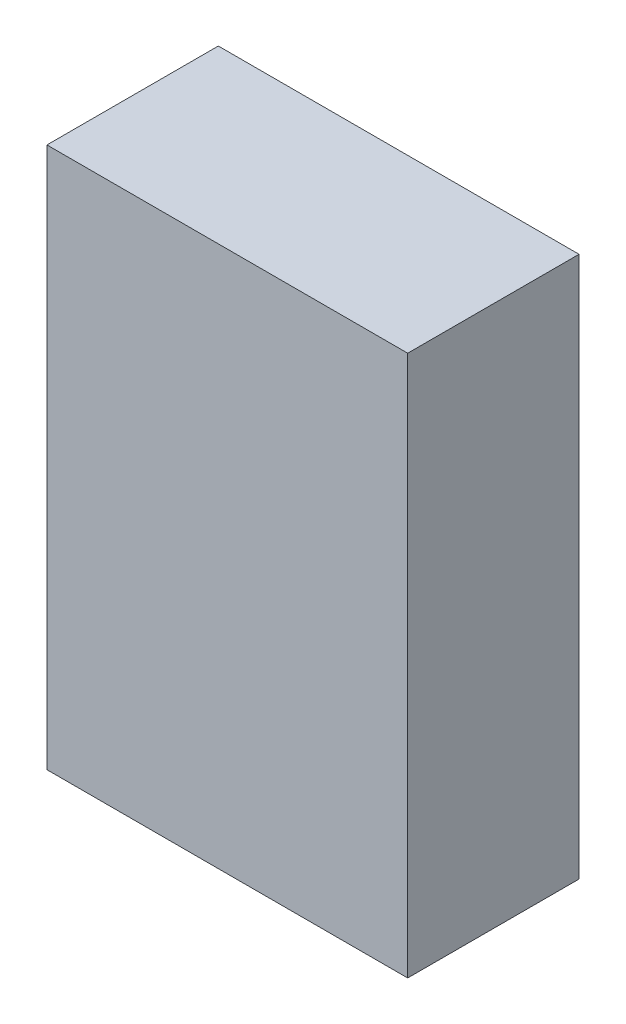
ISO-10303-21;
HEADER;
FILE_DESCRIPTION(('STEP AP214'),'2;1');
FILE_NAME('part.step','',(''),(''),'','','');
FILE_SCHEMA(('AUTOMOTIVE_DESIGN { 1 0 10303 214 1 1 1 1 }'));
ENDSEC;
DATA;
#1=APPLICATION_CONTEXT('core data for automotive mechanical design processes');
#2=APPLICATION_PROTOCOL_DEFINITION('international standard','automotive_design',2000,#1);
#3=PRODUCT_CONTEXT('',#1,'mechanical');
#4=PRODUCT('Part','Part','',(#3));
#5=PRODUCT_RELATED_PRODUCT_CATEGORY('part','',(#4));
#6=PRODUCT_DEFINITION_FORMATION('','',#4);
#7=PRODUCT_DEFINITION_CONTEXT('part definition',#1,'design');
#8=PRODUCT_DEFINITION('design','',#6,#7);
#9=PRODUCT_DEFINITION_SHAPE('','',#8);
#10=(LENGTH_UNIT() NAMED_UNIT(*) SI_UNIT(.MILLI.,.METRE.));
#11=(NAMED_UNIT(*) PLANE_ANGLE_UNIT() SI_UNIT($,.RADIAN.));
#12=(NAMED_UNIT(*) SI_UNIT($,.STERADIAN.) SOLID_ANGLE_UNIT());
#13=UNCERTAINTY_MEASURE_WITH_UNIT(LENGTH_MEASURE(1.E-05),#10,'distance_accuracy_value','');
#14=(GEOMETRIC_REPRESENTATION_CONTEXT(3) GLOBAL_UNCERTAINTY_ASSIGNED_CONTEXT((#13)) GLOBAL_UNIT_ASSIGNED_CONTEXT((#10,
#11,#12)) REPRESENTATION_CONTEXT('',''));
#15=CARTESIAN_POINT('',(0.,0.,0.));
#16=DIRECTION('',(0.,0.,1.));
#17=DIRECTION('',(1.,0.,0.));
#18=AXIS2_PLACEMENT_3D('',#15,#16,#17);
#19=CARTESIAN_POINT('',(-2.,3.,0.));
#20=DIRECTION('',(0.,1.,0.));
#21=DIRECTION('',(1.,0.,0.));
#22=AXIS2_PLACEMENT_3D('',#19,#20,#21);
#23=PLANE('',#22);
#24=DIRECTION('',(0.,0.,1.));
#25=VECTOR('',#24,1.);
#26=CARTESIAN_POINT('',(-2.,3.,0.));
#27=LINE('',#26,#25);
#28=CARTESIAN_POINT('',(-2.,3.,0.));
#29=VERTEX_POINT('',#28);
#30=CARTESIAN_POINT('',(-2.,3.,1.9));
#31=VERTEX_POINT('',#30);
#32=EDGE_CURVE('E11',#29,#31,#27,.T.);
#33=ORIENTED_EDGE('',*,*,#32,.T.);
#34=DIRECTION('',(1.,0.,0.));
#35=VECTOR('',#34,1.);
#36=CARTESIAN_POINT('',(-2.,3.,1.9));
#37=LINE('',#36,#35);
#38=CARTESIAN_POINT('',(2.,3.,1.9));
#39=VERTEX_POINT('',#38);
#40=EDGE_CURVE('E24',#31,#39,#37,.T.);
#41=ORIENTED_EDGE('',*,*,#40,.T.);
#42=DIRECTION('',(0.,0.,1.));
#43=VECTOR('',#42,1.);
#44=CARTESIAN_POINT('',(2.,3.,0.));
#45=LINE('',#44,#43);
#46=CARTESIAN_POINT('',(2.,3.,0.));
#47=VERTEX_POINT('',#46);
#48=EDGE_CURVE('E85',#47,#39,#45,.T.);
#49=ORIENTED_EDGE('',*,*,#48,.F.);
#50=DIRECTION('',(1.,0.,0.));
#51=VECTOR('',#50,1.);
#52=CARTESIAN_POINT('',(-2.,3.,0.));
#53=LINE('',#52,#51);
#54=EDGE_CURVE('E83',#29,#47,#53,.T.);
#55=ORIENTED_EDGE('',*,*,#54,.F.);
#56=EDGE_LOOP('',(#33,#41,#49,#55));
#57=FACE_BOUND('',#56,.T.);
#58=ADVANCED_FACE('F17',(#57),#23,.T.);
#59=CARTESIAN_POINT('',(2.,3.,0.));
#60=DIRECTION('',(1.,0.,0.));
#61=DIRECTION('',(0.,-1.,0.));
#62=AXIS2_PLACEMENT_3D('',#59,#60,#61);
#63=PLANE('',#62);
#64=ORIENTED_EDGE('',*,*,#48,.T.);
#65=DIRECTION('',(0.,-1.,0.));
#66=VECTOR('',#65,1.);
#67=CARTESIAN_POINT('',(2.,3.,1.9));
#68=LINE('',#67,#66);
#69=CARTESIAN_POINT('',(2.,-3.,1.9));
#70=VERTEX_POINT('',#69);
#71=EDGE_CURVE('E81',#39,#70,#68,.T.);
#72=ORIENTED_EDGE('',*,*,#71,.T.);
#73=DIRECTION('',(0.,0.,1.));
#74=VECTOR('',#73,1.);
#75=CARTESIAN_POINT('',(2.,-3.,0.));
#76=LINE('',#75,#74);
#77=CARTESIAN_POINT('',(2.,-3.,0.));
#78=VERTEX_POINT('',#77);
#79=EDGE_CURVE('E79',#78,#70,#76,.T.);
#80=ORIENTED_EDGE('',*,*,#79,.F.);
#81=DIRECTION('',(0.,-1.,0.));
#82=VECTOR('',#81,1.);
#83=CARTESIAN_POINT('',(2.,3.,0.));
#84=LINE('',#83,#82);
#85=EDGE_CURVE('E70',#47,#78,#84,.T.);
#86=ORIENTED_EDGE('',*,*,#85,.F.);
#87=EDGE_LOOP('',(#64,#72,#80,#86));
#88=FACE_BOUND('',#87,.T.);
#89=ADVANCED_FACE('F90',(#88),#63,.T.);
#90=CARTESIAN_POINT('',(2.,-3.,0.));
#91=DIRECTION('',(0.,-1.,0.));
#92=DIRECTION('',(-1.,0.,0.));
#93=AXIS2_PLACEMENT_3D('',#90,#91,#92);
#94=PLANE('',#93);
#95=ORIENTED_EDGE('',*,*,#79,.T.);
#96=DIRECTION('',(-1.,0.,0.));
#97=VECTOR('',#96,1.);
#98=CARTESIAN_POINT('',(2.,-3.,1.9));
#99=LINE('',#98,#97);
#100=CARTESIAN_POINT('',(-2.,-3.,1.9));
#101=VERTEX_POINT('',#100);
#102=EDGE_CURVE('E60',#70,#101,#99,.T.);
#103=ORIENTED_EDGE('',*,*,#102,.T.);
#104=DIRECTION('',(0.,0.,1.));
#105=VECTOR('',#104,1.);
#106=CARTESIAN_POINT('',(-2.,-3.,0.));
#107=LINE('',#106,#105);
#108=CARTESIAN_POINT('',(-2.,-3.,0.));
#109=VERTEX_POINT('',#108);
#110=EDGE_CURVE('E54',#109,#101,#107,.T.);
#111=ORIENTED_EDGE('',*,*,#110,.F.);
#112=DIRECTION('',(-1.,0.,0.));
#113=VECTOR('',#112,1.);
#114=CARTESIAN_POINT('',(2.,-3.,0.));
#115=LINE('',#114,#113);
#116=EDGE_CURVE('E58',#78,#109,#115,.T.);
#117=ORIENTED_EDGE('',*,*,#116,.F.);
#118=EDGE_LOOP('',(#95,#103,#111,#117));
#119=FACE_BOUND('',#118,.T.);
#120=ADVANCED_FACE('F57',(#119),#94,.T.);
#121=CARTESIAN_POINT('',(-2.,-3.,0.));
#122=DIRECTION('',(-1.,0.,0.));
#123=DIRECTION('',(0.,1.,0.));
#124=AXIS2_PLACEMENT_3D('',#121,#122,#123);
#125=PLANE('',#124);
#126=ORIENTED_EDGE('',*,*,#110,.T.);
#127=DIRECTION('',(0.,1.,0.));
#128=VECTOR('',#127,1.);
#129=CARTESIAN_POINT('',(-2.,-3.,1.9));
#130=LINE('',#129,#128);
#131=EDGE_CURVE('E71',#101,#31,#130,.T.);
#132=ORIENTED_EDGE('',*,*,#131,.T.);
#133=ORIENTED_EDGE('',*,*,#32,.F.);
#134=DIRECTION('',(0.,1.,0.));
#135=VECTOR('',#134,1.);
#136=CARTESIAN_POINT('',(-2.,-3.,0.));
#137=LINE('',#136,#135);
#138=EDGE_CURVE('E68',#109,#29,#137,.T.);
#139=ORIENTED_EDGE('',*,*,#138,.F.);
#140=EDGE_LOOP('',(#126,#132,#133,#139));
#141=FACE_BOUND('',#140,.T.);
#142=ADVANCED_FACE('F73',(#141),#125,.T.);
#143=CARTESIAN_POINT('',(0.,0.,0.));
#144=DIRECTION('',(0.,0.,-1.));
#145=DIRECTION('',(-1.,0.,0.));
#146=AXIS2_PLACEMENT_3D('',#143,#144,#145);
#147=PLANE('',#146);
#148=ORIENTED_EDGE('',*,*,#54,.T.);
#149=ORIENTED_EDGE('',*,*,#85,.T.);
#150=ORIENTED_EDGE('',*,*,#116,.T.);
#151=ORIENTED_EDGE('',*,*,#138,.T.);
#152=EDGE_LOOP('',(#148,#149,#150,#151));
#153=FACE_BOUND('',#152,.T.);
#154=ADVANCED_FACE('F67',(#153),#147,.T.);
#155=CARTESIAN_POINT('',(0.,0.,1.9));
#156=DIRECTION('',(0.,0.,-1.));
#157=DIRECTION('',(-1.,0.,0.));
#158=AXIS2_PLACEMENT_3D('',#155,#156,#157);
#159=PLANE('',#158);
#160=ORIENTED_EDGE('',*,*,#131,.F.);
#161=ORIENTED_EDGE('',*,*,#102,.F.);
#162=ORIENTED_EDGE('',*,*,#71,.F.);
#163=ORIENTED_EDGE('',*,*,#40,.F.);
#164=EDGE_LOOP('',(#160,#161,#162,#163));
#165=FACE_BOUND('',#164,.T.);
#166=ADVANCED_FACE('F91',(#165),#159,.F.);
#167=CLOSED_SHELL('',(#58,#89,#120,#142,#154,#166));
#168=MANIFOLD_SOLID_BREP('B1',#167);
#169=ADVANCED_BREP_SHAPE_REPRESENTATION('',(#18,#168),#14);
#170=SHAPE_DEFINITION_REPRESENTATION(#9,#169);
ENDSEC;
END-ISO-10303-21;
